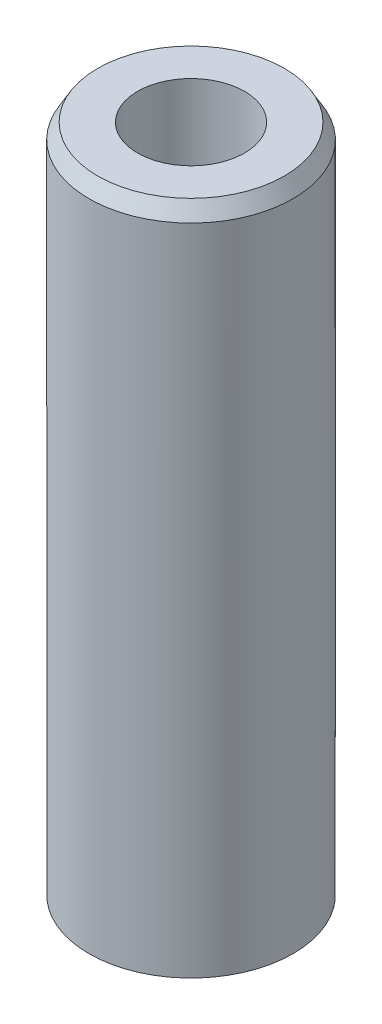
ISO-10303-21;
HEADER;
FILE_DESCRIPTION(('STEP AP214'),'2;1');
FILE_NAME('part.step','',(''),(''),'','','');
FILE_SCHEMA(('AUTOMOTIVE_DESIGN { 1 0 10303 214 1 1 1 1 }'));
ENDSEC;
DATA;
#1=APPLICATION_CONTEXT('core data for automotive mechanical design processes');
#2=APPLICATION_PROTOCOL_DEFINITION('international standard','automotive_design',2000,#1);
#3=PRODUCT_CONTEXT('',#1,'mechanical');
#4=PRODUCT('Part','Part','',(#3));
#5=PRODUCT_RELATED_PRODUCT_CATEGORY('part','',(#4));
#6=PRODUCT_DEFINITION_FORMATION('','',#4);
#7=PRODUCT_DEFINITION_CONTEXT('part definition',#1,'design');
#8=PRODUCT_DEFINITION('design','',#6,#7);
#9=PRODUCT_DEFINITION_SHAPE('','',#8);
#10=(LENGTH_UNIT() NAMED_UNIT(*) SI_UNIT(.MILLI.,.METRE.));
#11=(NAMED_UNIT(*) PLANE_ANGLE_UNIT() SI_UNIT($,.RADIAN.));
#12=(NAMED_UNIT(*) SI_UNIT($,.STERADIAN.) SOLID_ANGLE_UNIT());
#13=UNCERTAINTY_MEASURE_WITH_UNIT(LENGTH_MEASURE(1.E-05),#10,'distance_accuracy_value','');
#14=(GEOMETRIC_REPRESENTATION_CONTEXT(3) GLOBAL_UNCERTAINTY_ASSIGNED_CONTEXT((#13)) GLOBAL_UNIT_ASSIGNED_CONTEXT((#10,
#11,#12)) REPRESENTATION_CONTEXT('',''));
#15=CARTESIAN_POINT('',(0.,0.,0.));
#16=DIRECTION('',(0.,0.,1.));
#17=DIRECTION('',(1.,0.,0.));
#18=AXIS2_PLACEMENT_3D('',#15,#16,#17);
#19=CARTESIAN_POINT('',(0.,199.192233022009,0.));
#20=DIRECTION('',(0.,-1.,0.));
#21=DIRECTION('',(0.,0.,-1.));
#22=AXIS2_PLACEMENT_3D('',#19,#20,#21);
#23=CYLINDRICAL_SURFACE('',#22,30.);
#24=CARTESIAN_POINT('',(0.,194.718391440005,0.));
#25=DIRECTION('',(0.,1.,0.));
#26=DIRECTION('',(0.,0.,1.));
#27=AXIS2_PLACEMENT_3D('',#24,#25,#26);
#28=CIRCLE('',#27,30.);
#29=CARTESIAN_POINT('',(0.,194.718391440005,-30.));
#30=VERTEX_POINT('',#29);
#31=EDGE_CURVE('E50',#30,#30,#28,.F.);
#32=CARTESIAN_POINT('',(0.,2.58297364168167,0.));
#33=DIRECTION('',(0.,1.,0.));
#34=DIRECTION('',(0.,0.,1.));
#35=AXIS2_PLACEMENT_3D('',#32,#33,#34);
#36=CIRCLE('',#35,30.);
#37=CARTESIAN_POINT('',(0.,2.58297364168167,-30.));
#38=VERTEX_POINT('',#37);
#39=EDGE_CURVE('E51',#38,#38,#36,.T.);
#40=CARTESIAN_POINT('',(0.,194.718391440005,-30.));
#41=CARTESIAN_POINT('',(0.,192.716980837939,-30.));
#42=CARTESIAN_POINT('',(0.,190.715570235873,-30.));
#43=CARTESIAN_POINT('',(0.,186.712749031742,-30.));
#44=CARTESIAN_POINT('',(0.,184.711338429676,-30.));
#45=CARTESIAN_POINT('',(0.,180.708517225544,-30.));
#46=CARTESIAN_POINT('',(0.,178.707106623478,-30.));
#47=CARTESIAN_POINT('',(0.,174.704285419346,-30.));
#48=CARTESIAN_POINT('',(0.,172.702874817281,-30.));
#49=CARTESIAN_POINT('',(0.,168.700053613149,-30.));
#50=CARTESIAN_POINT('',(0.,166.698643011083,-30.));
#51=CARTESIAN_POINT('',(0.,162.695821806951,-30.));
#52=CARTESIAN_POINT('',(0.,160.694411204885,-30.));
#53=CARTESIAN_POINT('',(0.,156.691590000754,-30.));
#54=CARTESIAN_POINT('',(0.,154.690179398688,-30.));
#55=CARTESIAN_POINT('',(0.,150.687358194556,-30.));
#56=CARTESIAN_POINT('',(0.,148.68594759249,-30.));
#57=CARTESIAN_POINT('',(0.,144.683126388358,-30.));
#58=CARTESIAN_POINT('',(0.,142.681715786293,-30.));
#59=CARTESIAN_POINT('',(0.,138.678894582161,-30.));
#60=CARTESIAN_POINT('',(0.,136.677483980095,-30.));
#61=CARTESIAN_POINT('',(0.,132.674662775963,-30.));
#62=CARTESIAN_POINT('',(0.,130.673252173897,-30.));
#63=CARTESIAN_POINT('',(0.,126.670430969766,-30.));
#64=CARTESIAN_POINT('',(0.,124.6690203677,-30.));
#65=CARTESIAN_POINT('',(0.,120.666199163568,-30.));
#66=CARTESIAN_POINT('',(0.,118.664788561502,-30.));
#67=CARTESIAN_POINT('',(0.,114.66196735737,-30.));
#68=CARTESIAN_POINT('',(0.,112.660556755304,-30.));
#69=CARTESIAN_POINT('',(0.,108.657735551173,-30.));
#70=CARTESIAN_POINT('',(0.,106.656324949107,-30.));
#71=CARTESIAN_POINT('',(0.,102.653503744975,-30.));
#72=CARTESIAN_POINT('',(0.,100.652093142909,-30.));
#73=CARTESIAN_POINT('',(0.,96.6492719387775,-30.));
#74=CARTESIAN_POINT('',(0.,94.6478613367116,-30.));
#75=CARTESIAN_POINT('',(0.,90.6450401325799,-30.));
#76=CARTESIAN_POINT('',(0.,88.643629530514,-30.));
#77=CARTESIAN_POINT('',(0.,84.6408083263823,-30.));
#78=CARTESIAN_POINT('',(0.,82.6393977243164,-30.));
#79=CARTESIAN_POINT('',(0.,78.6365765201847,-30.));
#80=CARTESIAN_POINT('',(0.,76.6351659181188,-30.));
#81=CARTESIAN_POINT('',(0.,72.6323447139871,-30.));
#82=CARTESIAN_POINT('',(0.,70.6309341119212,-30.));
#83=CARTESIAN_POINT('',(0.,66.6281129077895,-30.));
#84=CARTESIAN_POINT('',(0.,64.6267023057236,-30.));
#85=CARTESIAN_POINT('',(0.,60.6238811015919,-30.));
#86=CARTESIAN_POINT('',(0.,58.622470499526,-30.));
#87=CARTESIAN_POINT('',(0.,54.6196492953943,-30.));
#88=CARTESIAN_POINT('',(0.,52.6182386933284,-30.));
#89=CARTESIAN_POINT('',(0.,48.6154174891967,-30.));
#90=CARTESIAN_POINT('',(0.,46.6140068871308,-30.));
#91=CARTESIAN_POINT('',(0.,42.6111856829991,-30.));
#92=CARTESIAN_POINT('',(0.,40.6097750809332,-30.));
#93=CARTESIAN_POINT('',(0.,36.6069538768014,-30.));
#94=CARTESIAN_POINT('',(0.,34.6055432747356,-30.));
#95=CARTESIAN_POINT('',(0.,30.6027220706038,-30.));
#96=CARTESIAN_POINT('',(0.,28.601311468538,-30.));
#97=CARTESIAN_POINT('',(0.,24.5984902644062,-30.));
#98=CARTESIAN_POINT('',(0.,22.5970796623404,-30.));
#99=CARTESIAN_POINT('',(0.,18.5942584582086,-30.));
#100=CARTESIAN_POINT('',(0.,16.5928478561428,-30.));
#101=CARTESIAN_POINT('',(0.,12.590026652011,-30.));
#102=CARTESIAN_POINT('',(0.,10.5886160499451,-30.));
#103=CARTESIAN_POINT('',(0.,6.58579484581341,-30.));
#104=CARTESIAN_POINT('',(0.,4.58438424374754,-30.));
#105=CARTESIAN_POINT('',(0.,2.58297364168167,-30.));
#106=B_SPLINE_CURVE_WITH_KNOTS('',3,(#40,#41,#42,#43,#44,#45,#46,#47,#48,#49,#50,#51,#52,#53,
#54,#55,#56,#57,#58,#59,#60,#61,#62,#63,#64,#65,#66,#67,#68,#69,#70,#71,#72,#73,#74,#75,#76,#77,
#78,#79,#80,#81,#82,#83,#84,#85,#86,#87,#88,#89,#90,#91,#92,#93,#94,#95,#96,#97,#98,#99,#100,
#101,#102,#103,#104,#105),.UNSPECIFIED.,.F.,.F.,(4,2,2,2,2,2,2,2,2,2,2,2,2,2,2,2,2,2,2,2,2,2,2,
2,2,2,2,2,2,2,2,2,4),(0.,6.00423180619758,12.0084636123952,18.0126954185928,24.0169272247904,
30.021159030988,36.0253908371856,42.0296226433832,48.0338544495808,54.0380862557784,
60.042318061976,66.0465498681736,72.0507816743713,78.0550134805689,84.0592452867665,
90.0634770929641,96.0677088991617,102.071940705359,108.076172511557,114.080404317754,
120.084636123952,126.08886793015,132.093099736347,138.097331542545,144.101563348743,
150.10579515494,156.110026961138,162.114258767335,168.118490573533,174.122722379731,
180.126954185928,186.131185992126,192.135417798323),.UNSPECIFIED.);
#107=EDGE_CURVE('BSEAM39',#30,#38,#106,.T.);
#108=ORIENTED_EDGE('',*,*,#31,.T.);
#109=ORIENTED_EDGE('',*,*,#39,.T.);
#110=ORIENTED_EDGE('',*,*,#107,.T.);
#111=ORIENTED_EDGE('',*,*,#107,.F.);
#112=EDGE_LOOP('',(#108,#110,#109,#111));
#113=FACE_BOUND('',#112,.T.);
#114=ADVANCED_FACE('F39',(#113),#23,.T.);
#115=CARTESIAN_POINT('',(0.,199.192233022009,0.));
#116=DIRECTION('',(0.,1.,0.));
#117=DIRECTION('',(0.,0.,1.));
#118=AXIS2_PLACEMENT_3D('',#115,#116,#117);
#119=PLANE('',#118);
#120=CARTESIAN_POINT('',(0.,199.192233022009,0.));
#121=DIRECTION('',(0.,1.,0.));
#122=DIRECTION('',(0.,0.,1.));
#123=AXIS2_PLACEMENT_3D('',#120,#121,#122);
#124=CIRCLE('',#123,27.4170263583184);
#125=CARTESIAN_POINT('',(0.,199.192233022009,27.4170263583184));
#126=VERTEX_POINT('',#125);
#127=EDGE_CURVE('E54',#126,#126,#124,.T.);
#128=ORIENTED_EDGE('',*,*,#127,.T.);
#129=EDGE_LOOP('',(#128));
#130=FACE_BOUND('',#129,.T.);
#131=CARTESIAN_POINT('',(0.,199.192233022009,0.));
#132=DIRECTION('',(0.,1.,0.));
#133=DIRECTION('',(0.,0.,1.));
#134=AXIS2_PLACEMENT_3D('',#131,#132,#133);
#135=CIRCLE('',#134,15.7210261925823);
#136=CARTESIAN_POINT('',(0.,199.192233022009,-15.7210261925823));
#137=VERTEX_POINT('',#136);
#138=EDGE_CURVE('E58',#137,#137,#135,.T.);
#139=ORIENTED_EDGE('',*,*,#138,.F.);
#140=EDGE_LOOP('',(#139));
#141=FACE_BOUND('',#140,.T.);
#142=ADVANCED_FACE('F69',(#130,#141),#119,.T.);
#143=CARTESIAN_POINT('',(0.,0.,0.));
#144=DIRECTION('',(0.,1.,0.));
#145=DIRECTION('',(0.,0.,1.));
#146=AXIS2_PLACEMENT_3D('',#143,#144,#145);
#147=PLANE('',#146);
#148=CARTESIAN_POINT('',(0.,0.,0.));
#149=DIRECTION('',(0.,1.,0.));
#150=DIRECTION('',(0.,0.,1.));
#151=AXIS2_PLACEMENT_3D('',#148,#149,#150);
#152=CIRCLE('',#151,25.5261584179961);
#153=CARTESIAN_POINT('',(0.,0.,25.5261584179961));
#154=VERTEX_POINT('',#153);
#155=EDGE_CURVE('E10',#154,#154,#152,.F.);
#156=ORIENTED_EDGE('',*,*,#155,.T.);
#157=EDGE_LOOP('',(#156));
#158=FACE_BOUND('',#157,.T.);
#159=CARTESIAN_POINT('',(0.,0.,0.));
#160=DIRECTION('',(0.,1.,0.));
#161=DIRECTION('',(0.,0.,1.));
#162=AXIS2_PLACEMENT_3D('',#159,#160,#161);
#163=CIRCLE('',#162,15.7210261925823);
#164=CARTESIAN_POINT('',(0.,0.,-15.7210261925823));
#165=VERTEX_POINT('',#164);
#166=EDGE_CURVE('E63',#165,#165,#163,.T.);
#167=ORIENTED_EDGE('',*,*,#166,.T.);
#168=EDGE_LOOP('',(#167));
#169=FACE_BOUND('',#168,.T.);
#170=ADVANCED_FACE('F75',(#158,#169),#147,.F.);
#171=CARTESIAN_POINT('',(0.,199.192233022009,0.));
#172=DIRECTION('',(0.,-1.,0.));
#173=DIRECTION('',(0.,0.,-1.));
#174=AXIS2_PLACEMENT_3D('',#171,#172,#173);
#175=CYLINDRICAL_SURFACE('',#174,15.7210261925823);
#176=CARTESIAN_POINT('',(0.,199.192233022009,-15.7210261925823));
#177=CARTESIAN_POINT('',(0.,197.11731392803,-15.7210261925823));
#178=CARTESIAN_POINT('',(0.,195.04239483405,-15.7210261925823));
#179=CARTESIAN_POINT('',(0.,190.892556646092,-15.7210261925823));
#180=CARTESIAN_POINT('',(0.,188.817637552112,-15.7210261925823));
#181=CARTESIAN_POINT('',(0.,184.667799364154,-15.7210261925823));
#182=CARTESIAN_POINT('',(0.,182.592880270175,-15.7210261925823));
#183=CARTESIAN_POINT('',(0.,178.443042082216,-15.7210261925823));
#184=CARTESIAN_POINT('',(0.,176.368122988237,-15.7210261925823));
#185=CARTESIAN_POINT('',(0.,172.218284800278,-15.7210261925823));
#186=CARTESIAN_POINT('',(0.,170.143365706299,-15.7210261925823));
#187=CARTESIAN_POINT('',(0.,165.993527518341,-15.7210261925823));
#188=CARTESIAN_POINT('',(0.,163.918608424361,-15.7210261925823));
#189=CARTESIAN_POINT('',(0.,159.768770236403,-15.7210261925823));
#190=CARTESIAN_POINT('',(0.,157.693851142424,-15.7210261925823));
#191=CARTESIAN_POINT('',(0.,153.544012954465,-15.7210261925823));
#192=CARTESIAN_POINT('',(0.,151.469093860486,-15.7210261925823));
#193=CARTESIAN_POINT('',(0.,147.319255672527,-15.7210261925823));
#194=CARTESIAN_POINT('',(0.,145.244336578548,-15.7210261925823));
#195=CARTESIAN_POINT('',(0.,141.09449839059,-15.7210261925823));
#196=CARTESIAN_POINT('',(0.,139.01957929661,-15.7210261925823));
#197=CARTESIAN_POINT('',(0.,134.869741108652,-15.7210261925823));
#198=CARTESIAN_POINT('',(0.,132.794822014672,-15.7210261925823));
#199=CARTESIAN_POINT('',(0.,128.644983826714,-15.7210261925823));
#200=CARTESIAN_POINT('',(0.,126.570064732735,-15.7210261925823));
#201=CARTESIAN_POINT('',(0.,122.420226544776,-15.7210261925823));
#202=CARTESIAN_POINT('',(0.,120.345307450797,-15.7210261925823));
#203=CARTESIAN_POINT('',(0.,116.195469262838,-15.7210261925823));
#204=CARTESIAN_POINT('',(0.,114.120550168859,-15.7210261925823));
#205=CARTESIAN_POINT('',(0.,109.970711980901,-15.7210261925823));
#206=CARTESIAN_POINT('',(0.,107.895792886921,-15.7210261925823));
#207=CARTESIAN_POINT('',(0.,103.745954698963,-15.7210261925823));
#208=CARTESIAN_POINT('',(0.,101.671035604984,-15.7210261925823));
#209=CARTESIAN_POINT('',(0.,97.5211974170251,-15.7210261925823));
#210=CARTESIAN_POINT('',(0.,95.4462783230458,-15.7210261925823));
#211=CARTESIAN_POINT('',(0.,91.2964401350873,-15.7210261925823));
#212=CARTESIAN_POINT('',(0.,89.2215210411081,-15.7210261925823));
#213=CARTESIAN_POINT('',(0.,85.0716828531496,-15.7210261925823));
#214=CARTESIAN_POINT('',(0.,82.9967637591703,-15.7210261925823));
#215=CARTESIAN_POINT('',(0.,78.8469255712118,-15.7210261925823));
#216=CARTESIAN_POINT('',(0.,76.7720064772325,-15.7210261925823));
#217=CARTESIAN_POINT('',(0.,72.622168289274,-15.7210261925823));
#218=CARTESIAN_POINT('',(0.,70.5472491952948,-15.7210261925823));
#219=CARTESIAN_POINT('',(0.,66.3974110073362,-15.7210261925823));
#220=CARTESIAN_POINT('',(0.,64.322491913357,-15.7210261925823));
#221=CARTESIAN_POINT('',(0.,60.1726537253985,-15.7210261925823));
#222=CARTESIAN_POINT('',(0.,58.0977346314192,-15.7210261925823));
#223=CARTESIAN_POINT('',(0.,53.9478964434607,-15.7210261925823));
#224=CARTESIAN_POINT('',(0.,51.8729773494814,-15.7210261925823));
#225=CARTESIAN_POINT('',(0.,47.7231391615229,-15.7210261925823));
#226=CARTESIAN_POINT('',(0.,45.6482200675437,-15.7210261925823));
#227=CARTESIAN_POINT('',(0.,41.4983818795851,-15.7210261925823));
#228=CARTESIAN_POINT('',(0.,39.4234627856059,-15.7210261925823));
#229=CARTESIAN_POINT('',(0.,35.2736245976474,-15.7210261925823));
#230=CARTESIAN_POINT('',(0.,33.1987055036681,-15.7210261925823));
#231=CARTESIAN_POINT('',(0.,29.0488673157096,-15.7210261925823));
#232=CARTESIAN_POINT('',(0.,26.9739482217303,-15.7210261925823));
#233=CARTESIAN_POINT('',(0.,22.8241100337718,-15.7210261925823));
#234=CARTESIAN_POINT('',(0.,20.7491909397926,-15.7210261925823));
#235=CARTESIAN_POINT('',(0.,16.599352751834,-15.7210261925823));
#236=CARTESIAN_POINT('',(0.,14.5244336578548,-15.7210261925823));
#237=CARTESIAN_POINT('',(0.,10.3745954698963,-15.7210261925823));
#238=CARTESIAN_POINT('',(0.,8.29967637591701,-15.7210261925823));
#239=CARTESIAN_POINT('',(0.,4.14983818795849,-15.7210261925823));
#240=CARTESIAN_POINT('',(0.,2.07491909397923,-15.7210261925823));
#241=CARTESIAN_POINT('',(0.,0.,-15.7210261925823));
#242=B_SPLINE_CURVE_WITH_KNOTS('',3,(#176,#177,#178,#179,#180,#181,#182,#183,#184,#185,#186,
#187,#188,#189,#190,#191,#192,#193,#194,#195,#196,#197,#198,#199,#200,#201,#202,#203,#204,#205,
#206,#207,#208,#209,#210,#211,#212,#213,#214,#215,#216,#217,#218,#219,#220,#221,#222,#223,#224,
#225,#226,#227,#228,#229,#230,#231,#232,#233,#234,#235,#236,#237,#238,#239,#240,#241),
.UNSPECIFIED.,.F.,.F.,(4,2,2,2,2,2,2,2,2,2,2,2,2,2,2,2,2,2,2,2,2,2,2,2,2,2,2,2,2,2,2,2,4),(0.,
6.22475728193778,12.4495145638756,18.6742718458133,24.8990291277511,31.1237864096889,
37.3485436916267,43.5733009735644,49.7980582555022,56.02281553744,62.2475728193778,
68.4723301013155,74.6970873832533,80.9218446651911,87.1466019471289,93.3713592290666,
99.5961165110044,105.820873792942,112.04563107488,118.270388356818,124.495145638756,
130.719902920693,136.944660202631,143.169417484569,149.394174766507,155.618932048444,
161.843689330382,168.06844661232,174.293203894258,180.517961176195,186.742718458133,
192.967475740071,199.192233022009),.UNSPECIFIED.);
#243=EDGE_CURVE('BSEAM70',#137,#165,#242,.T.);
#244=ORIENTED_EDGE('',*,*,#138,.T.);
#245=ORIENTED_EDGE('',*,*,#166,.F.);
#246=ORIENTED_EDGE('',*,*,#243,.T.);
#247=ORIENTED_EDGE('',*,*,#243,.F.);
#248=EDGE_LOOP('',(#244,#246,#245,#247));
#249=FACE_BOUND('',#248,.T.);
#250=ADVANCED_FACE('F70',(#249),#175,.F.);
#251=CARTESIAN_POINT('',(0.,199.192233022009,0.));
#252=DIRECTION('',(0.,-1.,0.));
#253=DIRECTION('',(0.,0.,-1.));
#254=AXIS2_PLACEMENT_3D('',#251,#252,#253);
#255=CONICAL_SURFACE('',#254,27.4170263583184,0.523598775598296);
#256=ORIENTED_EDGE('',*,*,#31,.F.);
#257=EDGE_LOOP('',(#256));
#258=FACE_BOUND('',#257,.T.);
#259=ORIENTED_EDGE('',*,*,#127,.F.);
#260=EDGE_LOOP('',(#259));
#261=FACE_BOUND('',#260,.T.);
#262=ADVANCED_FACE('F81',(#258,#261),#255,.T.);
#263=CARTESIAN_POINT('',(0.,2.58297364168167,0.));
#264=DIRECTION('',(0.,1.,0.));
#265=DIRECTION('',(0.,0.,1.));
#266=AXIS2_PLACEMENT_3D('',#263,#264,#265);
#267=CONICAL_SURFACE('',#266,30.,1.0471975511966);
#268=ORIENTED_EDGE('',*,*,#155,.F.);
#269=EDGE_LOOP('',(#268));
#270=FACE_BOUND('',#269,.T.);
#271=ORIENTED_EDGE('',*,*,#39,.F.);
#272=EDGE_LOOP('',(#271));
#273=FACE_BOUND('',#272,.T.);
#274=ADVANCED_FACE('F45',(#270,#273),#267,.T.);
#275=CLOSED_SHELL('',(#114,#142,#170,#250,#262,#274));
#276=MANIFOLD_SOLID_BREP('B2',#275);
#277=ADVANCED_BREP_SHAPE_REPRESENTATION('',(#18,#276),#14);
#278=SHAPE_DEFINITION_REPRESENTATION(#9,#277);
ENDSEC;
END-ISO-10303-21;
